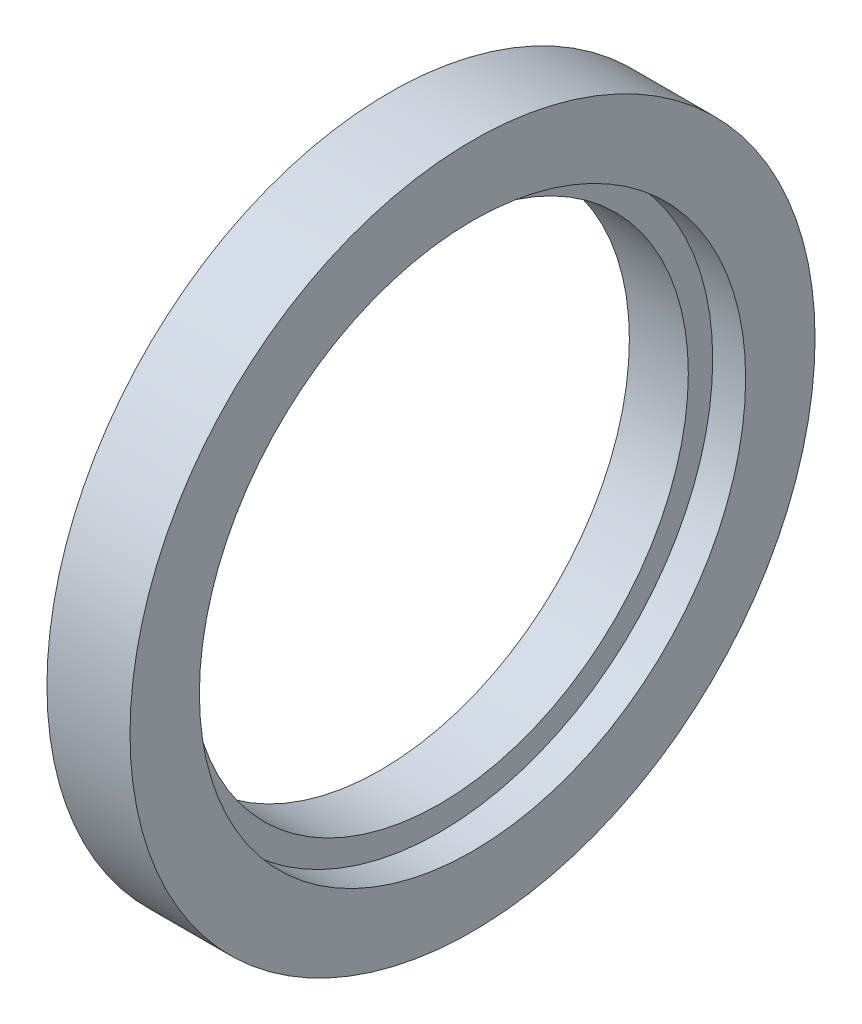
ISO-10303-21;
HEADER;
FILE_DESCRIPTION(('STEP AP214'),'2;1');
FILE_NAME('part.step','',(''),(''),'','','');
FILE_SCHEMA(('AUTOMOTIVE_DESIGN { 1 0 10303 214 1 1 1 1 }'));
ENDSEC;
DATA;
#1=APPLICATION_CONTEXT('core data for automotive mechanical design processes');
#2=APPLICATION_PROTOCOL_DEFINITION('international standard','automotive_design',2000,#1);
#3=PRODUCT_CONTEXT('',#1,'mechanical');
#4=PRODUCT('Part','Part','',(#3));
#5=PRODUCT_RELATED_PRODUCT_CATEGORY('part','',(#4));
#6=PRODUCT_DEFINITION_FORMATION('','',#4);
#7=PRODUCT_DEFINITION_CONTEXT('part definition',#1,'design');
#8=PRODUCT_DEFINITION('design','',#6,#7);
#9=PRODUCT_DEFINITION_SHAPE('','',#8);
#10=(LENGTH_UNIT() NAMED_UNIT(*) SI_UNIT(.MILLI.,.METRE.));
#11=(NAMED_UNIT(*) PLANE_ANGLE_UNIT() SI_UNIT($,.RADIAN.));
#12=(NAMED_UNIT(*) SI_UNIT($,.STERADIAN.) SOLID_ANGLE_UNIT());
#13=UNCERTAINTY_MEASURE_WITH_UNIT(LENGTH_MEASURE(1.E-05),#10,'distance_accuracy_value','');
#14=(GEOMETRIC_REPRESENTATION_CONTEXT(3) GLOBAL_UNCERTAINTY_ASSIGNED_CONTEXT((#13)) GLOBAL_UNIT_ASSIGNED_CONTEXT((#10,
#11,#12)) REPRESENTATION_CONTEXT('',''));
#15=CARTESIAN_POINT('',(0.,0.,0.));
#16=DIRECTION('',(0.,0.,1.));
#17=DIRECTION('',(1.,0.,0.));
#18=AXIS2_PLACEMENT_3D('',#15,#16,#17);
#19=CARTESIAN_POINT('',(2.0692999999999,0.,0.));
#20=DIRECTION('',(1.,0.,0.));
#21=DIRECTION('',(0.,0.,-1.));
#22=AXIS2_PLACEMENT_3D('',#19,#20,#21);
#23=CYLINDRICAL_SURFACE('',#22,17.4624999999999);
#24=CARTESIAN_POINT('',(4.13859999999983,0.,0.));
#25=DIRECTION('',(1.,0.,0.));
#26=DIRECTION('',(0.,0.,-1.));
#27=AXIS2_PLACEMENT_3D('',#24,#25,#26);
#28=CIRCLE('',#27,17.4624999999999);
#29=CARTESIAN_POINT('',(4.13859999999983,0.,-17.4624999999999));
#30=VERTEX_POINT('',#29);
#31=EDGE_CURVE('E17',#30,#30,#28,.F.);
#32=ORIENTED_EDGE('',*,*,#31,.F.);
#33=EDGE_LOOP('',(#32));
#34=FACE_BOUND('',#33,.T.);
#35=CARTESIAN_POINT('',(0.,0.,0.));
#36=DIRECTION('',(1.,0.,0.));
#37=DIRECTION('',(0.,0.,-1.));
#38=AXIS2_PLACEMENT_3D('',#35,#36,#37);
#39=CIRCLE('',#38,17.4624999999999);
#40=CARTESIAN_POINT('',(0.,0.,-17.4624999999999));
#41=VERTEX_POINT('',#40);
#42=EDGE_CURVE('E43',#41,#41,#39,.T.);
#43=ORIENTED_EDGE('',*,*,#42,.F.);
#44=EDGE_LOOP('',(#43));
#45=FACE_BOUND('',#44,.T.);
#46=ADVANCED_FACE('F14',(#34,#45),#23,.F.);
#47=CARTESIAN_POINT('',(4.13859999999983,18.3197499999999,0.));
#48=DIRECTION('',(1.,0.,0.));
#49=DIRECTION('',(0.,0.,-1.));
#50=AXIS2_PLACEMENT_3D('',#47,#48,#49);
#51=PLANE('',#50);
#52=ORIENTED_EDGE('',*,*,#31,.T.);
#53=EDGE_LOOP('',(#52));
#54=FACE_BOUND('',#53,.T.);
#55=CARTESIAN_POINT('',(4.13859999999983,0.,0.));
#56=DIRECTION('',(1.,0.,0.));
#57=DIRECTION('',(0.,0.,-1.));
#58=AXIS2_PLACEMENT_3D('',#55,#56,#57);
#59=CIRCLE('',#58,19.1769999999999);
#60=CARTESIAN_POINT('',(4.13859999999983,0.,-19.1769999999999));
#61=VERTEX_POINT('',#60);
#62=EDGE_CURVE('E41',#61,#61,#59,.T.);
#63=ORIENTED_EDGE('',*,*,#62,.T.);
#64=EDGE_LOOP('',(#63));
#65=FACE_BOUND('',#64,.T.);
#66=ADVANCED_FACE('F50',(#54,#65),#51,.T.);
#67=CARTESIAN_POINT('',(0.,19.2062500000005,0.));
#68=DIRECTION('',(-1.,0.,0.));
#69=DIRECTION('',(0.,0.,1.));
#70=AXIS2_PLACEMENT_3D('',#67,#68,#69);
#71=PLANE('',#70);
#72=ORIENTED_EDGE('',*,*,#42,.T.);
#73=EDGE_LOOP('',(#72));
#74=FACE_BOUND('',#73,.T.);
#75=CARTESIAN_POINT('',(0.,0.,0.));
#76=DIRECTION('',(1.,0.,0.));
#77=DIRECTION('',(0.,0.,-1.));
#78=AXIS2_PLACEMENT_3D('',#75,#76,#77);
#79=CIRCLE('',#78,20.950000000001);
#80=CARTESIAN_POINT('',(0.,0.,-20.950000000001));
#81=VERTEX_POINT('',#80);
#82=EDGE_CURVE('E38',#81,#81,#79,.F.);
#83=ORIENTED_EDGE('',*,*,#82,.T.);
#84=EDGE_LOOP('',(#83));
#85=FACE_BOUND('',#84,.T.);
#86=ADVANCED_FACE('F61',(#74,#85),#71,.T.);
#87=CARTESIAN_POINT('',(5.29429999999922,0.,0.));
#88=DIRECTION('',(1.,0.,0.));
#89=DIRECTION('',(0.,0.,-1.));
#90=AXIS2_PLACEMENT_3D('',#87,#88,#89);
#91=CYLINDRICAL_SURFACE('',#90,19.1769999999999);
#92=CARTESIAN_POINT('',(6.44999999999861,0.,0.));
#93=DIRECTION('',(1.,0.,0.));
#94=DIRECTION('',(0.,0.,-1.));
#95=AXIS2_PLACEMENT_3D('',#92,#93,#94);
#96=CIRCLE('',#95,19.1769999999999);
#97=CARTESIAN_POINT('',(6.44999999999861,0.,-19.1769999999999));
#98=VERTEX_POINT('',#97);
#99=EDGE_CURVE('E33',#98,#98,#96,.F.);
#100=ORIENTED_EDGE('',*,*,#99,.F.);
#101=EDGE_LOOP('',(#100));
#102=FACE_BOUND('',#101,.T.);
#103=ORIENTED_EDGE('',*,*,#62,.F.);
#104=EDGE_LOOP('',(#103));
#105=FACE_BOUND('',#104,.T.);
#106=ADVANCED_FACE('F80',(#102,#105),#91,.F.);
#107=CARTESIAN_POINT('',(-0.255000000000098,0.,0.));
#108=DIRECTION('',(1.,0.,0.));
#109=DIRECTION('',(0.,0.,-1.));
#110=AXIS2_PLACEMENT_3D('',#107,#108,#109);
#111=CYLINDRICAL_SURFACE('',#110,20.950000000001);
#112=ORIENTED_EDGE('',*,*,#82,.F.);
#113=EDGE_LOOP('',(#112));
#114=FACE_BOUND('',#113,.T.);
#115=CARTESIAN_POINT('',(-0.510000002164026,0.,0.));
#116=DIRECTION('',(1.,0.,0.));
#117=DIRECTION('',(0.,1.,0.));
#118=AXIS2_PLACEMENT_3D('',#115,#116,#117);
#119=CIRCLE('',#118,20.9500000007886);
#120=CARTESIAN_POINT('',(-0.510000002164026,20.9500000007886,0.));
#121=VERTEX_POINT('',#120);
#122=EDGE_CURVE('E26',#121,#121,#119,.T.);
#123=ORIENTED_EDGE('',*,*,#122,.F.);
#124=EDGE_LOOP('',(#123));
#125=FACE_BOUND('',#124,.T.);
#126=ADVANCED_FACE('F76',(#114,#125),#111,.F.);
#127=CARTESIAN_POINT('',(6.44999999999861,21.6135000000001,0.));
#128=DIRECTION('',(1.,0.,0.));
#129=DIRECTION('',(0.,0.,-1.));
#130=AXIS2_PLACEMENT_3D('',#127,#128,#129);
#131=PLANE('',#130);
#132=ORIENTED_EDGE('',*,*,#99,.T.);
#133=EDGE_LOOP('',(#132));
#134=FACE_BOUND('',#133,.T.);
#135=CARTESIAN_POINT('',(6.44999999999861,0.,0.));
#136=DIRECTION('',(1.,0.,0.));
#137=DIRECTION('',(0.,0.,-1.));
#138=AXIS2_PLACEMENT_3D('',#135,#136,#137);
#139=CIRCLE('',#138,24.0500000000003);
#140=CARTESIAN_POINT('',(6.44999999999861,0.,-24.0500000000003));
#141=VERTEX_POINT('',#140);
#142=EDGE_CURVE('E21',#141,#141,#139,.F.);
#143=ORIENTED_EDGE('',*,*,#142,.F.);
#144=EDGE_LOOP('',(#143));
#145=FACE_BOUND('',#144,.T.);
#146=ADVANCED_FACE('F69',(#134,#145),#131,.T.);
#147=CARTESIAN_POINT('',(0.618307728388946,0.,0.));
#148=DIRECTION('',(1.,0.,0.));
#149=DIRECTION('',(0.,0.,-1.));
#150=AXIS2_PLACEMENT_3D('',#147,#148,#149);
#151=CONICAL_SURFACE('',#150,24.0499999992128,1.22173047499991);
#152=ORIENTED_EDGE('',*,*,#122,.T.);
#153=EDGE_LOOP('',(#152));
#154=FACE_BOUND('',#153,.T.);
#155=CARTESIAN_POINT('',(0.618307726225102,0.,0.));
#156=DIRECTION('',(1.,0.,0.));
#157=DIRECTION('',(0.,0.,-1.));
#158=AXIS2_PLACEMENT_3D('',#155,#156,#157);
#159=CIRCLE('',#158,24.0500000000003);
#160=CARTESIAN_POINT('',(0.618307726225102,0.,-24.0500000000003));
#161=VERTEX_POINT('',#160);
#162=EDGE_CURVE('E10',#161,#161,#159,.T.);
#163=ORIENTED_EDGE('',*,*,#162,.F.);
#164=EDGE_LOOP('',(#163));
#165=FACE_BOUND('',#164,.T.);
#166=ADVANCED_FACE('F63',(#154,#165),#151,.T.);
#167=CARTESIAN_POINT('',(3.53415386311184,0.,0.));
#168=DIRECTION('',(1.,0.,0.));
#169=DIRECTION('',(0.,0.,-1.));
#170=AXIS2_PLACEMENT_3D('',#167,#168,#169);
#171=CYLINDRICAL_SURFACE('',#170,24.0500000000003);
#172=ORIENTED_EDGE('',*,*,#162,.T.);
#173=EDGE_LOOP('',(#172));
#174=FACE_BOUND('',#173,.T.);
#175=ORIENTED_EDGE('',*,*,#142,.T.);
#176=EDGE_LOOP('',(#175));
#177=FACE_BOUND('',#176,.T.);
#178=ADVANCED_FACE('F62',(#174,#177),#171,.T.);
#179=CLOSED_SHELL('',(#46,#66,#86,#106,#126,#146,#166,#178));
#180=MANIFOLD_SOLID_BREP('B1',#179);
#181=ADVANCED_BREP_SHAPE_REPRESENTATION('',(#18,#180),#14);
#182=SHAPE_DEFINITION_REPRESENTATION(#9,#181);
ENDSEC;
END-ISO-10303-21;
